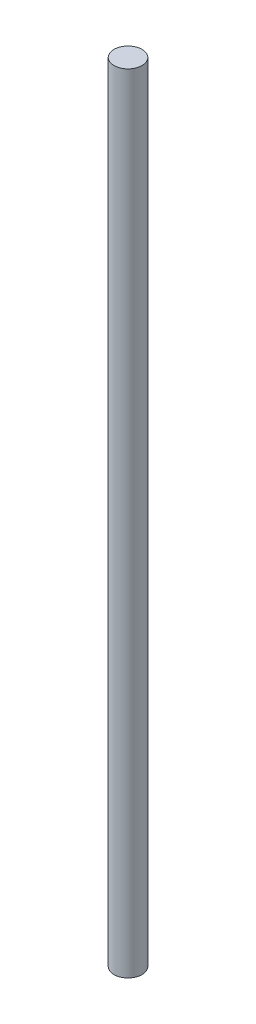
ISO-10303-21;
HEADER;
FILE_DESCRIPTION(('STEP AP214'),'2;1');
FILE_NAME('part.step','',(''),(''),'','','');
FILE_SCHEMA(('AUTOMOTIVE_DESIGN { 1 0 10303 214 1 1 1 1 }'));
ENDSEC;
DATA;
#1=APPLICATION_CONTEXT('core data for automotive mechanical design processes');
#2=APPLICATION_PROTOCOL_DEFINITION('international standard','automotive_design',2000,#1);
#3=PRODUCT_CONTEXT('',#1,'mechanical');
#4=PRODUCT('Part','Part','',(#3));
#5=PRODUCT_RELATED_PRODUCT_CATEGORY('part','',(#4));
#6=PRODUCT_DEFINITION_FORMATION('','',#4);
#7=PRODUCT_DEFINITION_CONTEXT('part definition',#1,'design');
#8=PRODUCT_DEFINITION('design','',#6,#7);
#9=PRODUCT_DEFINITION_SHAPE('','',#8);
#10=(LENGTH_UNIT() NAMED_UNIT(*) SI_UNIT(.MILLI.,.METRE.));
#11=(NAMED_UNIT(*) PLANE_ANGLE_UNIT() SI_UNIT($,.RADIAN.));
#12=(NAMED_UNIT(*) SI_UNIT($,.STERADIAN.) SOLID_ANGLE_UNIT());
#13=UNCERTAINTY_MEASURE_WITH_UNIT(LENGTH_MEASURE(1.E-05),#10,'distance_accuracy_value','');
#14=(GEOMETRIC_REPRESENTATION_CONTEXT(3) GLOBAL_UNCERTAINTY_ASSIGNED_CONTEXT((#13)) GLOBAL_UNIT_ASSIGNED_CONTEXT((#10,
#11,#12)) REPRESENTATION_CONTEXT('',''));
#15=CARTESIAN_POINT('',(0.,0.,0.));
#16=DIRECTION('',(0.,0.,1.));
#17=DIRECTION('',(1.,0.,0.));
#18=AXIS2_PLACEMENT_3D('',#15,#16,#17);
#19=CARTESIAN_POINT('',(0.,204.,0.));
#20=DIRECTION('',(0.,-1.,0.));
#21=DIRECTION('',(1.,0.,0.));
#22=AXIS2_PLACEMENT_3D('',#19,#20,#21);
#23=CYLINDRICAL_SURFACE('',#22,4.44999999999999);
#24=CARTESIAN_POINT('',(0.,204.,0.));
#25=DIRECTION('',(0.,-1.,0.));
#26=DIRECTION('',(1.,0.,0.));
#27=AXIS2_PLACEMENT_3D('',#24,#25,#26);
#28=CIRCLE('',#27,4.45);
#29=CARTESIAN_POINT('',(4.45,204.,0.));
#30=VERTEX_POINT('',#29);
#31=EDGE_CURVE('E10',#30,#30,#28,.T.);
#32=ORIENTED_EDGE('',*,*,#31,.T.);
#33=EDGE_LOOP('',(#32));
#34=FACE_BOUND('',#33,.T.);
#35=CARTESIAN_POINT('',(0.,-46.,0.));
#36=DIRECTION('',(0.,-1.,0.));
#37=DIRECTION('',(1.,0.,0.));
#38=AXIS2_PLACEMENT_3D('',#35,#36,#37);
#39=CIRCLE('',#38,4.44999999999997);
#40=CARTESIAN_POINT('',(4.45,-46.,0.));
#41=VERTEX_POINT('',#40);
#42=EDGE_CURVE('E40',#41,#41,#39,.T.);
#43=ORIENTED_EDGE('',*,*,#42,.F.);
#44=EDGE_LOOP('',(#43));
#45=FACE_BOUND('',#44,.T.);
#46=ADVANCED_FACE('F34',(#34,#45),#23,.T.);
#47=CARTESIAN_POINT('',(4.45,204.,0.));
#48=DIRECTION('',(0.,1.,0.));
#49=DIRECTION('',(-1.,0.,0.));
#50=AXIS2_PLACEMENT_3D('',#47,#48,#49);
#51=PLANE('',#50);
#52=ORIENTED_EDGE('',*,*,#31,.F.);
#53=EDGE_LOOP('',(#52));
#54=FACE_BOUND('',#53,.T.);
#55=ADVANCED_FACE('F49',(#54),#51,.T.);
#56=CARTESIAN_POINT('',(0.,-46.,0.));
#57=DIRECTION('',(0.,-1.,0.));
#58=DIRECTION('',(1.,0.,0.));
#59=AXIS2_PLACEMENT_3D('',#56,#57,#58);
#60=PLANE('',#59);
#61=ORIENTED_EDGE('',*,*,#42,.T.);
#62=EDGE_LOOP('',(#61));
#63=FACE_BOUND('',#62,.T.);
#64=ADVANCED_FACE('F46',(#63),#60,.T.);
#65=CLOSED_SHELL('',(#46,#55,#64));
#66=MANIFOLD_SOLID_BREP('B2',#65);
#67=ADVANCED_BREP_SHAPE_REPRESENTATION('',(#18,#66),#14);
#68=SHAPE_DEFINITION_REPRESENTATION(#9,#67);
ENDSEC;
END-ISO-10303-21;
